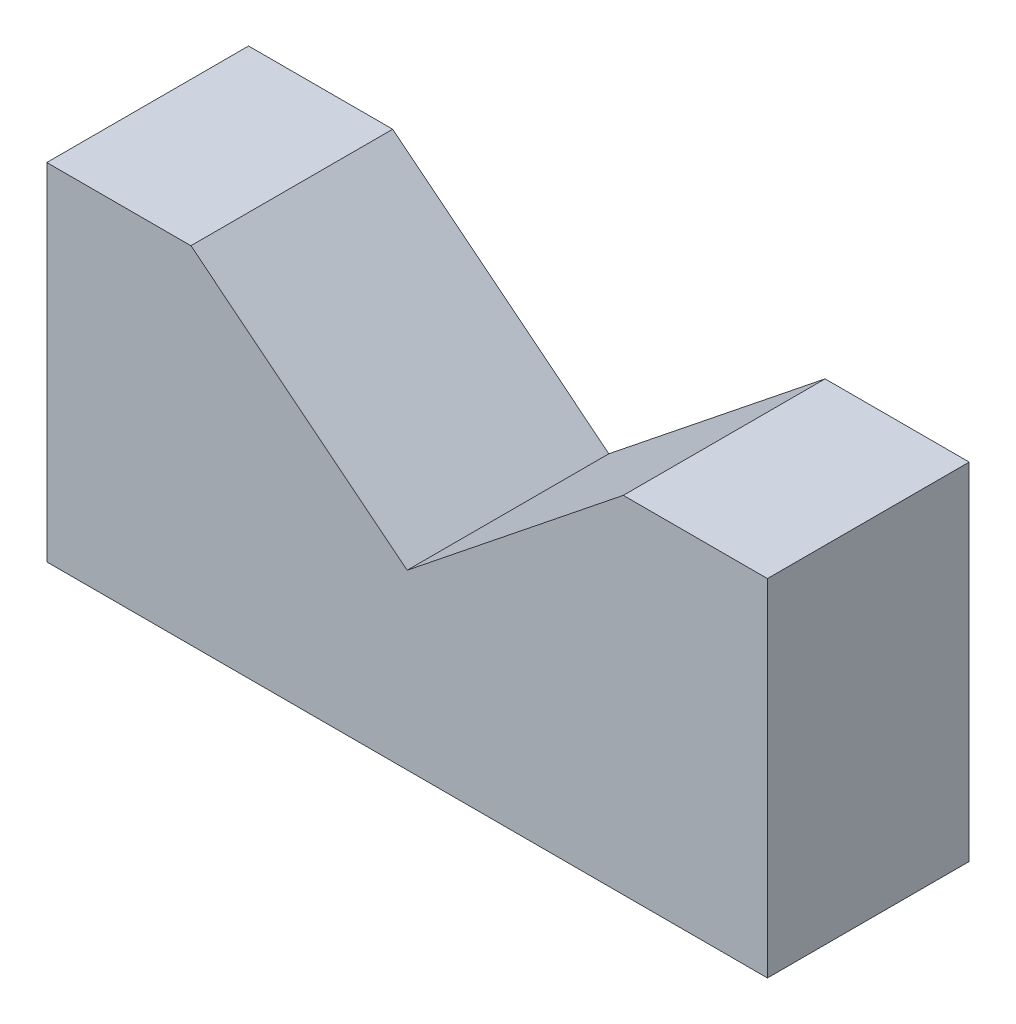
ISO-10303-21;
HEADER;
FILE_DESCRIPTION(('STEP AP214'),'2;1');
FILE_NAME('part.step','',(''),(''),'','','');
FILE_SCHEMA(('AUTOMOTIVE_DESIGN { 1 0 10303 214 1 1 1 1 }'));
ENDSEC;
DATA;
#1=APPLICATION_CONTEXT('core data for automotive mechanical design processes');
#2=APPLICATION_PROTOCOL_DEFINITION('international standard','automotive_design',2000,#1);
#3=PRODUCT_CONTEXT('',#1,'mechanical');
#4=PRODUCT('Part','Part','',(#3));
#5=PRODUCT_RELATED_PRODUCT_CATEGORY('part','',(#4));
#6=PRODUCT_DEFINITION_FORMATION('','',#4);
#7=PRODUCT_DEFINITION_CONTEXT('part definition',#1,'design');
#8=PRODUCT_DEFINITION('design','',#6,#7);
#9=PRODUCT_DEFINITION_SHAPE('','',#8);
#10=(LENGTH_UNIT() NAMED_UNIT(*) SI_UNIT(.MILLI.,.METRE.));
#11=(NAMED_UNIT(*) PLANE_ANGLE_UNIT() SI_UNIT($,.RADIAN.));
#12=(NAMED_UNIT(*) SI_UNIT($,.STERADIAN.) SOLID_ANGLE_UNIT());
#13=UNCERTAINTY_MEASURE_WITH_UNIT(LENGTH_MEASURE(1.E-05),#10,'distance_accuracy_value','');
#14=(GEOMETRIC_REPRESENTATION_CONTEXT(3) GLOBAL_UNCERTAINTY_ASSIGNED_CONTEXT((#13)) GLOBAL_UNIT_ASSIGNED_CONTEXT((#10,
#11,#12)) REPRESENTATION_CONTEXT('',''));
#15=CARTESIAN_POINT('',(0.,0.,0.));
#16=DIRECTION('',(0.,0.,1.));
#17=DIRECTION('',(1.,0.,0.));
#18=AXIS2_PLACEMENT_3D('',#15,#16,#17);
#19=CARTESIAN_POINT('',(-125.,120.,70.));
#20=DIRECTION('',(0.,-1.,0.));
#21=DIRECTION('',(0.,0.,-1.));
#22=AXIS2_PLACEMENT_3D('',#19,#20,#21);
#23=PLANE('',#22);
#24=DIRECTION('',(-1.,0.,0.));
#25=VECTOR('',#24,1.);
#26=CARTESIAN_POINT('',(-125.,120.,0.));
#27=LINE('',#26,#25);
#28=CARTESIAN_POINT('',(-75.,120.,0.));
#29=VERTEX_POINT('',#28);
#30=CARTESIAN_POINT('',(-125.,120.,0.));
#31=VERTEX_POINT('',#30);
#32=EDGE_CURVE('E122',#29,#31,#27,.T.);
#33=ORIENTED_EDGE('',*,*,#32,.T.);
#34=DIRECTION('',(0.,0.,-1.));
#35=VECTOR('',#34,1.);
#36=CARTESIAN_POINT('',(-125.,120.,70.));
#37=LINE('',#36,#35);
#38=CARTESIAN_POINT('',(-125.,120.,70.));
#39=VERTEX_POINT('',#38);
#40=EDGE_CURVE('E11',#39,#31,#37,.T.);
#41=ORIENTED_EDGE('',*,*,#40,.F.);
#42=DIRECTION('',(-1.,0.,0.));
#43=VECTOR('',#42,1.);
#44=CARTESIAN_POINT('',(-125.,120.,70.));
#45=LINE('',#44,#43);
#46=CARTESIAN_POINT('',(-75.,120.,70.));
#47=VERTEX_POINT('',#46);
#48=EDGE_CURVE('E134',#47,#39,#45,.T.);
#49=ORIENTED_EDGE('',*,*,#48,.F.);
#50=DIRECTION('',(0.,0.,-1.));
#51=VECTOR('',#50,1.);
#52=CARTESIAN_POINT('',(-75.,120.,70.));
#53=LINE('',#52,#51);
#54=EDGE_CURVE('E118',#47,#29,#53,.T.);
#55=ORIENTED_EDGE('',*,*,#54,.T.);
#56=EDGE_LOOP('',(#33,#41,#49,#55));
#57=FACE_BOUND('',#56,.T.);
#58=ADVANCED_FACE('F32',(#57),#23,.F.);
#59=CARTESIAN_POINT('',(-125.,0.,70.));
#60=DIRECTION('',(1.,0.,0.));
#61=DIRECTION('',(0.,0.,-1.));
#62=AXIS2_PLACEMENT_3D('',#59,#60,#61);
#63=PLANE('',#62);
#64=DIRECTION('',(0.,-1.,0.));
#65=VECTOR('',#64,1.);
#66=CARTESIAN_POINT('',(-125.,0.,0.));
#67=LINE('',#66,#65);
#68=CARTESIAN_POINT('',(-125.,0.,0.));
#69=VERTEX_POINT('',#68);
#70=EDGE_CURVE('E125',#31,#69,#67,.T.);
#71=ORIENTED_EDGE('',*,*,#70,.T.);
#72=DIRECTION('',(0.,0.,-1.));
#73=VECTOR('',#72,1.);
#74=CARTESIAN_POINT('',(-125.,0.,70.));
#75=LINE('',#74,#73);
#76=CARTESIAN_POINT('',(-125.,0.,70.));
#77=VERTEX_POINT('',#76);
#78=EDGE_CURVE('E40',#77,#69,#75,.T.);
#79=ORIENTED_EDGE('',*,*,#78,.F.);
#80=DIRECTION('',(0.,-1.,0.));
#81=VECTOR('',#80,1.);
#82=CARTESIAN_POINT('',(-125.,0.,70.));
#83=LINE('',#82,#81);
#84=EDGE_CURVE('E88',#39,#77,#83,.T.);
#85=ORIENTED_EDGE('',*,*,#84,.F.);
#86=ORIENTED_EDGE('',*,*,#40,.T.);
#87=EDGE_LOOP('',(#71,#79,#85,#86));
#88=FACE_BOUND('',#87,.T.);
#89=ADVANCED_FACE('F159',(#88),#63,.F.);
#90=CARTESIAN_POINT('',(-125.,0.,70.));
#91=DIRECTION('',(0.,1.,0.));
#92=DIRECTION('',(-1.,0.,0.));
#93=AXIS2_PLACEMENT_3D('',#90,#91,#92);
#94=PLANE('',#93);
#95=DIRECTION('',(1.,0.,0.));
#96=VECTOR('',#95,1.);
#97=CARTESIAN_POINT('',(-125.,0.,0.));
#98=LINE('',#97,#96);
#99=CARTESIAN_POINT('',(125.,0.,0.));
#100=VERTEX_POINT('',#99);
#101=EDGE_CURVE('E127',#69,#100,#98,.T.);
#102=ORIENTED_EDGE('',*,*,#101,.T.);
#103=DIRECTION('',(0.,0.,-1.));
#104=VECTOR('',#103,1.);
#105=CARTESIAN_POINT('',(125.,0.,70.));
#106=LINE('',#105,#104);
#107=CARTESIAN_POINT('',(125.,0.,70.));
#108=VERTEX_POINT('',#107);
#109=EDGE_CURVE('E138',#108,#100,#106,.T.);
#110=ORIENTED_EDGE('',*,*,#109,.F.);
#111=DIRECTION('',(1.,0.,0.));
#112=VECTOR('',#111,1.);
#113=CARTESIAN_POINT('',(-125.,0.,70.));
#114=LINE('',#113,#112);
#115=EDGE_CURVE('E146',#77,#108,#114,.T.);
#116=ORIENTED_EDGE('',*,*,#115,.F.);
#117=ORIENTED_EDGE('',*,*,#78,.T.);
#118=EDGE_LOOP('',(#102,#110,#116,#117));
#119=FACE_BOUND('',#118,.T.);
#120=ADVANCED_FACE('F144',(#119),#94,.F.);
#121=CARTESIAN_POINT('',(125.,0.,70.));
#122=DIRECTION('',(-1.,0.,0.));
#123=DIRECTION('',(0.,0.,1.));
#124=AXIS2_PLACEMENT_3D('',#121,#122,#123);
#125=PLANE('',#124);
#126=DIRECTION('',(0.,1.,0.));
#127=VECTOR('',#126,1.);
#128=CARTESIAN_POINT('',(125.,0.,0.));
#129=LINE('',#128,#127);
#130=CARTESIAN_POINT('',(125.,120.,0.));
#131=VERTEX_POINT('',#130);
#132=EDGE_CURVE('E129',#100,#131,#129,.T.);
#133=ORIENTED_EDGE('',*,*,#132,.T.);
#134=DIRECTION('',(0.,0.,-1.));
#135=VECTOR('',#134,1.);
#136=CARTESIAN_POINT('',(125.,120.,70.));
#137=LINE('',#136,#135);
#138=CARTESIAN_POINT('',(125.,120.,70.));
#139=VERTEX_POINT('',#138);
#140=EDGE_CURVE('E113',#139,#131,#137,.T.);
#141=ORIENTED_EDGE('',*,*,#140,.F.);
#142=DIRECTION('',(0.,1.,0.));
#143=VECTOR('',#142,1.);
#144=CARTESIAN_POINT('',(125.,0.,70.));
#145=LINE('',#144,#143);
#146=EDGE_CURVE('E104',#108,#139,#145,.T.);
#147=ORIENTED_EDGE('',*,*,#146,.F.);
#148=ORIENTED_EDGE('',*,*,#109,.T.);
#149=EDGE_LOOP('',(#133,#141,#147,#148));
#150=FACE_BOUND('',#149,.T.);
#151=ADVANCED_FACE('F152',(#150),#125,.F.);
#152=CARTESIAN_POINT('',(125.,120.,70.));
#153=DIRECTION('',(0.,-1.,0.));
#154=DIRECTION('',(0.,0.,-1.));
#155=AXIS2_PLACEMENT_3D('',#152,#153,#154);
#156=PLANE('',#155);
#157=DIRECTION('',(-1.,0.,0.));
#158=VECTOR('',#157,1.);
#159=CARTESIAN_POINT('',(125.,120.,0.));
#160=LINE('',#159,#158);
#161=CARTESIAN_POINT('',(75.,120.,0.));
#162=VERTEX_POINT('',#161);
#163=EDGE_CURVE('E112',#131,#162,#160,.T.);
#164=ORIENTED_EDGE('',*,*,#163,.T.);
#165=DIRECTION('',(0.,0.,-1.));
#166=VECTOR('',#165,1.);
#167=CARTESIAN_POINT('',(75.,120.,70.));
#168=LINE('',#167,#166);
#169=CARTESIAN_POINT('',(75.,120.,70.));
#170=VERTEX_POINT('',#169);
#171=EDGE_CURVE('E109',#170,#162,#168,.T.);
#172=ORIENTED_EDGE('',*,*,#171,.F.);
#173=DIRECTION('',(-1.,0.,0.));
#174=VECTOR('',#173,1.);
#175=CARTESIAN_POINT('',(125.,120.,70.));
#176=LINE('',#175,#174);
#177=EDGE_CURVE('E98',#139,#170,#176,.T.);
#178=ORIENTED_EDGE('',*,*,#177,.F.);
#179=ORIENTED_EDGE('',*,*,#140,.T.);
#180=EDGE_LOOP('',(#164,#172,#178,#179));
#181=FACE_BOUND('',#180,.T.);
#182=ADVANCED_FACE('F110',(#181),#156,.F.);
#183=CARTESIAN_POINT('',(0.,60.,70.));
#184=DIRECTION('',(0.624695047554424,-0.78086880944303,0.));
#185=DIRECTION('',(0.78086880944303,0.624695047554424,0.));
#186=AXIS2_PLACEMENT_3D('',#183,#184,#185);
#187=PLANE('',#186);
#188=DIRECTION('',(-0.78086880944303,-0.624695047554424,0.));
#189=VECTOR('',#188,1.);
#190=CARTESIAN_POINT('',(0.,60.,0.));
#191=LINE('',#190,#189);
#192=CARTESIAN_POINT('',(0.,60.,0.));
#193=VERTEX_POINT('',#192);
#194=EDGE_CURVE('E74',#162,#193,#191,.T.);
#195=ORIENTED_EDGE('',*,*,#194,.T.);
#196=DIRECTION('',(0.,0.,-1.));
#197=VECTOR('',#196,1.);
#198=CARTESIAN_POINT('',(0.,60.,70.));
#199=LINE('',#198,#197);
#200=CARTESIAN_POINT('',(0.,60.,70.));
#201=VERTEX_POINT('',#200);
#202=EDGE_CURVE('E114',#201,#193,#199,.T.);
#203=ORIENTED_EDGE('',*,*,#202,.F.);
#204=DIRECTION('',(-0.78086880944303,-0.624695047554424,0.));
#205=VECTOR('',#204,1.);
#206=CARTESIAN_POINT('',(0.,60.,70.));
#207=LINE('',#206,#205);
#208=EDGE_CURVE('E102',#170,#201,#207,.T.);
#209=ORIENTED_EDGE('',*,*,#208,.F.);
#210=ORIENTED_EDGE('',*,*,#171,.T.);
#211=EDGE_LOOP('',(#195,#203,#209,#210));
#212=FACE_BOUND('',#211,.T.);
#213=ADVANCED_FACE('F116',(#212),#187,.F.);
#214=CARTESIAN_POINT('',(-75.,120.,70.));
#215=DIRECTION('',(-0.624695047554424,-0.78086880944303,0.));
#216=DIRECTION('',(0.78086880944303,-0.624695047554424,0.));
#217=AXIS2_PLACEMENT_3D('',#214,#215,#216);
#218=PLANE('',#217);
#219=DIRECTION('',(-0.78086880944303,0.624695047554424,0.));
#220=VECTOR('',#219,1.);
#221=CARTESIAN_POINT('',(-75.,120.,0.));
#222=LINE('',#221,#220);
#223=EDGE_CURVE('E80',#193,#29,#222,.T.);
#224=ORIENTED_EDGE('',*,*,#223,.T.);
#225=ORIENTED_EDGE('',*,*,#54,.F.);
#226=DIRECTION('',(-0.78086880944303,0.624695047554424,0.));
#227=VECTOR('',#226,1.);
#228=CARTESIAN_POINT('',(-75.,120.,70.));
#229=LINE('',#228,#227);
#230=EDGE_CURVE('E48',#201,#47,#229,.T.);
#231=ORIENTED_EDGE('',*,*,#230,.F.);
#232=ORIENTED_EDGE('',*,*,#202,.T.);
#233=EDGE_LOOP('',(#224,#225,#231,#232));
#234=FACE_BOUND('',#233,.T.);
#235=ADVANCED_FACE('F173',(#234),#218,.F.);
#236=CARTESIAN_POINT('',(0.,0.,70.));
#237=DIRECTION('',(0.,0.,1.));
#238=DIRECTION('',(1.,0.,0.));
#239=AXIS2_PLACEMENT_3D('',#236,#237,#238);
#240=PLANE('',#239);
#241=ORIENTED_EDGE('',*,*,#48,.T.);
#242=ORIENTED_EDGE('',*,*,#84,.T.);
#243=ORIENTED_EDGE('',*,*,#115,.T.);
#244=ORIENTED_EDGE('',*,*,#146,.T.);
#245=ORIENTED_EDGE('',*,*,#177,.T.);
#246=ORIENTED_EDGE('',*,*,#208,.T.);
#247=ORIENTED_EDGE('',*,*,#230,.T.);
#248=EDGE_LOOP('',(#241,#242,#243,#244,#245,#246,#247));
#249=FACE_BOUND('',#248,.T.);
#250=ADVANCED_FACE('F100',(#249),#240,.T.);
#251=CARTESIAN_POINT('',(0.,0.,0.));
#252=DIRECTION('',(0.,0.,1.));
#253=DIRECTION('',(1.,0.,0.));
#254=AXIS2_PLACEMENT_3D('',#251,#252,#253);
#255=PLANE('',#254);
#256=ORIENTED_EDGE('',*,*,#32,.F.);
#257=ORIENTED_EDGE('',*,*,#223,.F.);
#258=ORIENTED_EDGE('',*,*,#194,.F.);
#259=ORIENTED_EDGE('',*,*,#163,.F.);
#260=ORIENTED_EDGE('',*,*,#132,.F.);
#261=ORIENTED_EDGE('',*,*,#101,.F.);
#262=ORIENTED_EDGE('',*,*,#70,.F.);
#263=EDGE_LOOP('',(#256,#257,#258,#259,#260,#261,#262));
#264=FACE_BOUND('',#263,.T.);
#265=ADVANCED_FACE('F150',(#264),#255,.F.);
#266=CLOSED_SHELL('',(#58,#89,#120,#151,#182,#213,#235,#250,#265));
#267=MANIFOLD_SOLID_BREP('B2',#266);
#268=ADVANCED_BREP_SHAPE_REPRESENTATION('',(#18,#267),#14);
#269=SHAPE_DEFINITION_REPRESENTATION(#9,#268);
ENDSEC;
END-ISO-10303-21;
